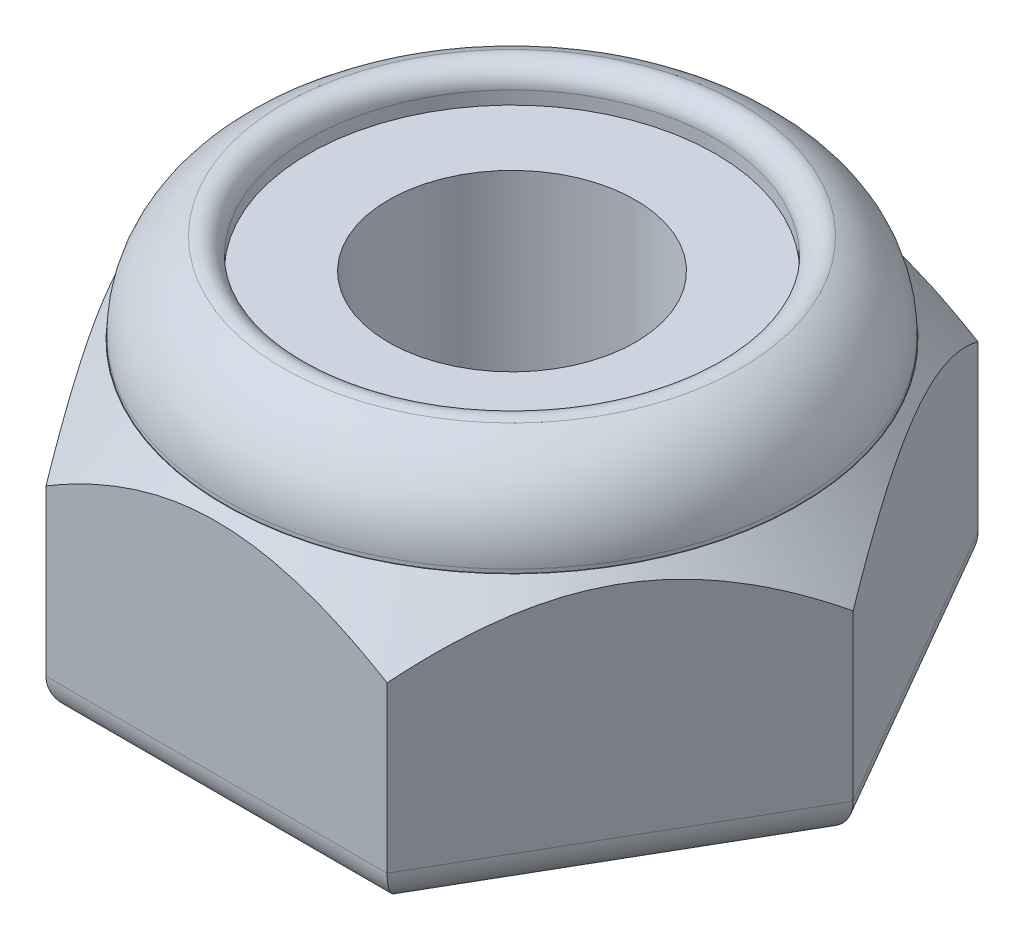
ISO-10303-21;
HEADER;
FILE_DESCRIPTION(('STEP AP214'),'2;1');
FILE_NAME('part.step','',(''),(''),'','','');
FILE_SCHEMA(('AUTOMOTIVE_DESIGN { 1 0 10303 214 1 1 1 1 }'));
ENDSEC;
DATA;
#1=APPLICATION_CONTEXT('core data for automotive mechanical design processes');
#2=APPLICATION_PROTOCOL_DEFINITION('international standard','automotive_design',2000,#1);
#3=PRODUCT_CONTEXT('',#1,'mechanical');
#4=PRODUCT('Part','Part','',(#3));
#5=PRODUCT_RELATED_PRODUCT_CATEGORY('part','',(#4));
#6=PRODUCT_DEFINITION_FORMATION('','',#4);
#7=PRODUCT_DEFINITION_CONTEXT('part definition',#1,'design');
#8=PRODUCT_DEFINITION('design','',#6,#7);
#9=PRODUCT_DEFINITION_SHAPE('','',#8);
#10=(LENGTH_UNIT() NAMED_UNIT(*) SI_UNIT(.MILLI.,.METRE.));
#11=(NAMED_UNIT(*) PLANE_ANGLE_UNIT() SI_UNIT($,.RADIAN.));
#12=(NAMED_UNIT(*) SI_UNIT($,.STERADIAN.) SOLID_ANGLE_UNIT());
#13=UNCERTAINTY_MEASURE_WITH_UNIT(LENGTH_MEASURE(1.E-05),#10,'distance_accuracy_value','');
#14=(GEOMETRIC_REPRESENTATION_CONTEXT(3) GLOBAL_UNCERTAINTY_ASSIGNED_CONTEXT((#13)) GLOBAL_UNIT_ASSIGNED_CONTEXT((#10,
#11,#12)) REPRESENTATION_CONTEXT('',''));
#15=CARTESIAN_POINT('',(0.,0.,0.));
#16=DIRECTION('',(0.,0.,1.));
#17=DIRECTION('',(1.,0.,0.));
#18=AXIS2_PLACEMENT_3D('',#15,#16,#17);
#19=CARTESIAN_POINT('',(0.,4.9784,0.));
#20=DIRECTION('',(0.,-1.,0.));
#21=DIRECTION('',(0.,0.,-1.));
#22=AXIS2_PLACEMENT_3D('',#19,#20,#21);
#23=CYLINDRICAL_SURFACE('',#22,3.937);
#24=CARTESIAN_POINT('',(0.,3.7084,0.));
#25=DIRECTION('',(0.,1.,0.));
#26=DIRECTION('',(0.,0.,1.));
#27=AXIS2_PLACEMENT_3D('',#24,#25,#26);
#28=CIRCLE('',#27,3.937);
#29=CARTESIAN_POINT('',(0.,3.7084,3.937));
#30=VERTEX_POINT('',#29);
#31=EDGE_CURVE('E244',#30,#30,#28,.T.);
#32=ORIENTED_EDGE('',*,*,#31,.F.);
#33=EDGE_LOOP('',(#32));
#34=FACE_BOUND('',#33,.T.);
#35=CARTESIAN_POINT('',(0.,3.6576,0.));
#36=DIRECTION('',(0.,-1.,0.));
#37=DIRECTION('',(0.,0.,-1.));
#38=AXIS2_PLACEMENT_3D('',#35,#36,#37);
#39=CIRCLE('',#38,3.937);
#40=CARTESIAN_POINT('',(0.,3.6576,-3.937));
#41=VERTEX_POINT('',#40);
#42=EDGE_CURVE('E20',#41,#41,#39,.F.);
#43=ORIENTED_EDGE('',*,*,#42,.T.);
#44=EDGE_LOOP('',(#43));
#45=FACE_BOUND('',#44,.T.);
#46=ADVANCED_FACE('F17',(#34,#45),#23,.T.);
#47=CARTESIAN_POINT('',(0.,3.7084,0.));
#48=DIRECTION('',(0.,1.,0.));
#49=DIRECTION('',(0.,0.,1.));
#50=AXIS2_PLACEMENT_3D('',#47,#48,#49);
#51=TOROIDAL_SURFACE('',#50,2.667,1.27);
#52=ORIENTED_EDGE('',*,*,#31,.T.);
#53=EDGE_LOOP('',(#52));
#54=FACE_BOUND('',#53,.T.);
#55=CARTESIAN_POINT('',(0.,4.88572150982644,0.));
#56=DIRECTION('',(0.,-1.,0.));
#57=DIRECTION('',(0.,0.,-1.));
#58=AXIS2_PLACEMENT_3D('',#55,#56,#57);
#59=CIRCLE('',#58,3.14325);
#60=CARTESIAN_POINT('',(0.,4.88572150982644,-3.14325));
#61=VERTEX_POINT('',#60);
#62=EDGE_CURVE('E238',#61,#61,#59,.F.);
#63=ORIENTED_EDGE('',*,*,#62,.F.);
#64=EDGE_LOOP('',(#63));
#65=FACE_BOUND('',#64,.T.);
#66=ADVANCED_FACE('F135',(#54,#65),#51,.T.);
#67=CARTESIAN_POINT('',(2.34315,3.6576,4.05845484975502));
#68=DIRECTION('',(0.,-1.,0.));
#69=DIRECTION('',(0.,0.,-1.));
#70=AXIS2_PLACEMENT_3D('',#67,#68,#69);
#71=PLANE('',#70);
#72=ORIENTED_EDGE('',*,*,#42,.F.);
#73=EDGE_LOOP('',(#72));
#74=FACE_BOUND('',#73,.T.);
#75=CARTESIAN_POINT('',(0.,3.65760000011051,0.));
#76=DIRECTION('',(0.,-1.,0.));
#77=DIRECTION('',(0.,0.,-1.));
#78=AXIS2_PLACEMENT_3D('',#75,#76,#77);
#79=CIRCLE('',#78,3.94407100938664);
#80=CARTESIAN_POINT('',(0.,3.65760000011051,-3.94407100938664));
#81=VERTEX_POINT('',#80);
#82=EDGE_CURVE('E120',#81,#81,#79,.T.);
#83=ORIENTED_EDGE('',*,*,#82,.F.);
#84=EDGE_LOOP('',(#83));
#85=FACE_BOUND('',#84,.T.);
#86=ADVANCED_FACE('F130',(#74,#85),#71,.F.);
#87=CARTESIAN_POINT('',(0.,4.65025720786115,0.));
#88=DIRECTION('',(0.,-1.,0.));
#89=DIRECTION('',(0.,0.,-1.));
#90=AXIS2_PLACEMENT_3D('',#87,#88,#89);
#91=TOROIDAL_SURFACE('',#90,3.048,0.254);
#92=CARTESIAN_POINT('',(0.,4.65025720786115,0.));
#93=DIRECTION('',(0.,1.,0.));
#94=DIRECTION('',(0.,0.,1.));
#95=AXIS2_PLACEMENT_3D('',#92,#93,#94);
#96=CIRCLE('',#95,2.794);
#97=CARTESIAN_POINT('',(0.,4.65025720786115,2.794));
#98=VERTEX_POINT('',#97);
#99=EDGE_CURVE('E105',#98,#98,#96,.F.);
#100=ORIENTED_EDGE('',*,*,#99,.T.);
#101=EDGE_LOOP('',(#100));
#102=FACE_BOUND('',#101,.T.);
#103=ORIENTED_EDGE('',*,*,#62,.T.);
#104=EDGE_LOOP('',(#103));
#105=FACE_BOUND('',#104,.T.);
#106=ADVANCED_FACE('F126',(#102,#105),#91,.T.);
#107=CARTESIAN_POINT('',(0.,2.76773860969115,0.));
#108=DIRECTION('',(0.,-1.,0.));
#109=DIRECTION('',(0.,0.,-1.));
#110=AXIS2_PLACEMENT_3D('',#107,#108,#109);
#111=CONICAL_SURFACE('',#110,4.69075337389313,0.698131700802158);
#112=CARTESIAN_POINT('',(-4.68630000001476,2.77304593398821,-5.3333815551093E-11));
#113=CARTESIAN_POINT('',(-4.65177717141793,2.81418235889091,0.0597952931149053));
#114=CARTESIAN_POINT('',(-4.61695780288956,2.85432113110728,0.120104208500933));
#115=CARTESIAN_POINT('',(-4.54666264441453,2.93230661020916,0.241858994511412));
#116=CARTESIAN_POINT('',(-4.51118655194523,2.97015222462005,0.303305389120424));
#117=CARTESIAN_POINT('',(-4.40329561885259,3.08018701500149,0.490177966909938));
#118=CARTESIAN_POINT('',(-4.32983334004397,3.14837015576205,0.617418366247689));
#119=CARTESIAN_POINT('',(-4.1797796499728,3.27092778609509,0.877318981315214));
#120=CARTESIAN_POINT('',(-4.10317943932402,3.32525984886677,1.00999443802899));
#121=CARTESIAN_POINT('',(-3.94747591651278,3.41577217646147,1.27968085045525));
#122=CARTESIAN_POINT('',(-3.86837998243724,3.45200143013375,1.4166790269463));
#123=CARTESIAN_POINT('',(-3.73746585196202,3.49372811243502,1.64342895235813));
#124=CARTESIAN_POINT('',(-3.68614686019516,3.50560413715319,1.73231605349153));
#125=CARTESIAN_POINT('',(-3.58316406708587,3.52008140702852,1.91068748346216));
#126=CARTESIAN_POINT('',(-3.53150020834088,3.5226810675312,2.00017191172355));
#127=CARTESIAN_POINT('',(-3.42855034551142,3.51847006524789,2.17848630477643));
#128=CARTESIAN_POINT('',(-3.3772638088531,3.51171021118305,2.26731719201287));
#129=CARTESIAN_POINT('',(-3.27519197708947,3.48921023555424,2.4441107906491));
#130=CARTESIAN_POINT('',(-3.22440670715057,3.4734696654174,2.53207345845939));
#131=CARTESIAN_POINT('',(-3.10963060134479,3.42817062222156,2.73087150520989));
#132=CARTESIAN_POINT('',(-3.04589899577138,3.39598542076133,2.84125788411098));
#133=CARTESIAN_POINT('',(-2.92018166739655,3.32004827846255,3.05900668424801));
#134=CARTESIAN_POINT('',(-2.85819691962206,3.27629001415058,3.16636741668776));
#135=CARTESIAN_POINT('',(-2.735889068299,3.17910361386979,3.37821082934389));
#136=CARTESIAN_POINT('',(-2.67557364738244,3.12563730731956,3.48268020285126));
#137=CARTESIAN_POINT('',(-2.55683004320588,3.01104764609313,3.68835015835892));
#138=CARTESIAN_POINT('',(-2.49840123089761,2.94992687749399,3.78955182990274));
#139=CARTESIAN_POINT('',(-2.42439626092569,2.86741854625153,3.91773219790672));
#140=CARTESIAN_POINT('',(-2.40802320106583,2.84883596648691,3.94609116945937));
#141=CARTESIAN_POINT('',(-2.3754621576302,2.81125673907332,4.00248855103733));
#142=CARTESIAN_POINT('',(-2.35927376441604,2.79226151161516,4.03052767057717));
#143=CARTESIAN_POINT('',(-2.3431499999717,2.77304593399368,4.05845484980404));
#144=B_SPLINE_CURVE_WITH_KNOTS('',3,(#112,#113,#114,#115,#116,#117,#118,#119,#120,#121,#122,
#123,#124,#125,#126,#127,#128,#129,#130,#131,#132,#133,#134,#135,#136,#137,#138,#139,#140,#141,
#142,#143),.UNSPECIFIED.,.F.,.F.,(4,2,2,2,2,2,2,2,2,2,2,2,2,2,2,4),(0.,0.241096809088565,
0.48230758945251,0.967637153847365,1.45443592242802,1.93991010956963,2.24950193433618,
2.5591466432483,2.86711700071403,3.17510274216898,3.56882084711336,3.96275452403261,
4.35827201930639,4.75365624679115,4.86660838982693,4.97921936905084),.UNSPECIFIED.);
#145=CARTESIAN_POINT('',(-4.68630000002839,2.77304593399358,0.));
#146=VERTEX_POINT('',#145);
#147=CARTESIAN_POINT('',(-2.34315000001419,2.77304593399358,4.05845484977959));
#148=VERTEX_POINT('',#147);
#149=EDGE_CURVE('E92',#146,#148,#144,.T.);
#150=ORIENTED_EDGE('',*,*,#149,.T.);
#151=CARTESIAN_POINT('',(-2.34315000005357,2.77304593398822,4.05845484974113));
#152=CARTESIAN_POINT('',(-2.27415972170409,2.81414935271336,4.05845484974989));
#153=CARTESIAN_POINT('',(-2.20457738522044,2.85425669884705,4.05845484975361));
#154=CARTESIAN_POINT('',(-2.06410193528096,2.93218331968193,4.05845484975642));
#155=CARTESIAN_POINT('',(-1.99320821641151,2.9700015013142,4.05845484975551));
#156=CARTESIAN_POINT('',(-1.77754688772429,3.07999086386455,4.05845484975401));
#157=CARTESIAN_POINT('',(-1.63068545869954,3.1481589403704,4.05845484975469));
#158=CARTESIAN_POINT('',(-1.33052752457963,3.27077676919262,4.05845484975534));
#159=CARTESIAN_POINT('',(-1.17720631609342,3.32516696804196,4.0584548497553));
#160=CARTESIAN_POINT('',(-0.865613503807779,3.41574608766059,4.05845484975473));
#161=CARTESIAN_POINT('',(-0.707359229311903,3.45199244874899,4.0584548497542));
#162=CARTESIAN_POINT('',(-0.456822143345071,3.49192146546895,4.05845484975548));
#163=CARTESIAN_POINT('',(-0.365672921156202,3.50290887295604,4.05845484975637));
#164=CARTESIAN_POINT('',(-0.183016322004482,3.51758027913678,4.05845484975366));
#165=CARTESIAN_POINT('',(-0.0915105175250817,3.52128341037061,4.05845484975007));
#166=CARTESIAN_POINT('',(0.104649468641441,3.52128177491765,4.0584548497495));
#167=CARTESIAN_POINT('',(0.209305100872023,3.51643705333648,4.05845484975354));
#168=CARTESIAN_POINT('',(0.417787181909869,3.49730239560235,4.05845484975649));
#169=CARTESIAN_POINT('',(0.521613181352877,3.48300765111694,4.05845484975541));
#170=CARTESIAN_POINT('',(0.728332544913562,3.44553375886282,4.05845484975462));
#171=CARTESIAN_POINT('',(0.831215331558566,3.42229697724238,4.05845484975491));
#172=CARTESIAN_POINT('',(1.03487580391125,3.36791830054733,4.05845484975512));
#173=CARTESIAN_POINT('',(1.13565289468809,3.33677420321768,4.05845484975504));
#174=CARTESIAN_POINT('',(1.33273383822163,3.26838741918099,4.05845484975499));
#175=CARTESIAN_POINT('',(1.42908716226035,3.23128582684656,4.05845484975501));
#176=CARTESIAN_POINT('',(1.61947291708309,3.15151071591982,4.05845484975502));
#177=CARTESIAN_POINT('',(1.71350470709807,3.10883567899407,4.05845484975502));
#178=CARTESIAN_POINT('',(1.89803195382395,3.01941532331662,4.05845484975501));
#179=CARTESIAN_POINT('',(1.98855798046432,2.97273255726059,4.05845484975502));
#180=CARTESIAN_POINT('',(2.16742834958163,2.87556944084479,4.05845484975502));
#181=CARTESIAN_POINT('',(2.25577492892455,2.82509321932285,4.05845484975502));
#182=CARTESIAN_POINT('',(2.34315000005566,2.77304593399424,4.05845484975502));
#183=B_SPLINE_CURVE_WITH_KNOTS('',3,(#151,#152,#153,#154,#155,#156,#157,#158,#159,#160,#161,
#162,#163,#164,#165,#166,#167,#168,#169,#170,#171,#172,#173,#174,#175,#176,#177,#178,#179,#180,
#181,#182),.UNSPECIFIED.,.F.,.F.,(4,2,2,2,2,2,2,2,2,2,2,2,2,2,2,4),(0.,0.24090330355952,
0.481920744736242,0.967059466968448,1.4542606837498,1.93990959177135,2.21507934695766,
2.4895253838939,2.80337599596431,3.11738642360394,3.43345557972405,3.74961286055439,
4.0591611810716,4.36879400620232,4.67425708545867,4.97939238068026),.UNSPECIFIED.);
#184=CARTESIAN_POINT('',(2.34315000001419,2.77304593399358,4.05845484977959));
#185=VERTEX_POINT('',#184);
#186=EDGE_CURVE('E84',#148,#185,#183,.T.);
#187=ORIENTED_EDGE('',*,*,#186,.T.);
#188=CARTESIAN_POINT('',(2.3431499999612,2.77304593398822,4.05845484979446));
#189=CARTESIAN_POINT('',(2.37767282857321,2.81418235889091,3.99865955663499));
#190=CARTESIAN_POINT('',(2.41249219710801,2.85432113110729,3.93835064125267));
#191=CARTESIAN_POINT('',(2.48278735558791,2.93230661020917,3.816595855245));
#192=CARTESIAN_POINT('',(2.51826344805563,2.97015222462005,3.75514946063508));
#193=CARTESIAN_POINT('',(2.62615438114571,3.08018701500149,3.56827688284408));
#194=CARTESIAN_POINT('',(2.69961665995557,3.14837015576206,3.44103648350706));
#195=CARTESIAN_POINT('',(2.84967035002766,3.2709277860951,3.18113586844006));
#196=CARTESIAN_POINT('',(2.9262705606761,3.32525984886677,3.04846041172609));
#197=CARTESIAN_POINT('',(3.08197408348711,3.41577217646148,2.77877399929969));
#198=CARTESIAN_POINT('',(3.16107001756274,3.45200143013376,2.64177582280869));
#199=CARTESIAN_POINT('',(3.291984148038,3.49372811243503,2.41502589739689));
#200=CARTESIAN_POINT('',(3.34330313980485,3.50560413715319,2.32613879626348));
#201=CARTESIAN_POINT('',(3.44628593291413,3.52008140702853,2.14776736629285));
#202=CARTESIAN_POINT('',(3.49794979165912,3.52268106753121,2.05828293803146));
#203=CARTESIAN_POINT('',(3.60089965448859,3.51847006524789,1.87996854497858));
#204=CARTESIAN_POINT('',(3.6521861911469,3.51171021118306,1.79113765774214));
#205=CARTESIAN_POINT('',(3.75425802291053,3.48921023555425,1.61434405910591));
#206=CARTESIAN_POINT('',(3.80504329284943,3.47346966541741,1.52638139129562));
#207=CARTESIAN_POINT('',(3.91981939865521,3.42817062222156,1.32758334454512));
#208=CARTESIAN_POINT('',(3.98355100422862,3.39598542076133,1.21719696564403));
#209=CARTESIAN_POINT('',(4.10926833260345,3.32004827846255,0.999448165506999));
#210=CARTESIAN_POINT('',(4.17125308037794,3.27629001415058,0.892087433067251));
#211=CARTESIAN_POINT('',(4.293560931701,3.17910361386979,0.680244020411125));
#212=CARTESIAN_POINT('',(4.35387635261756,3.12563730731956,0.575774646903749));
#213=CARTESIAN_POINT('',(4.47261995679412,3.01104764609313,0.370104691396086));
#214=CARTESIAN_POINT('',(4.53104876910239,2.94992687749399,0.268903019852268));
#215=CARTESIAN_POINT('',(4.60505373907431,2.86741854625153,0.140722651848287));
#216=CARTESIAN_POINT('',(4.62142679893417,2.84883596648691,0.112363680295636));
#217=CARTESIAN_POINT('',(4.6539878423698,2.81125673907332,0.055966298717677));
#218=CARTESIAN_POINT('',(4.67017623558396,2.79226151161516,0.0279271791778412));
#219=CARTESIAN_POINT('',(4.6863000000283,2.77304593399368,-4.90273860582746E-11));
#220=B_SPLINE_CURVE_WITH_KNOTS('',3,(#188,#189,#190,#191,#192,#193,#194,#195,#196,#197,#198,
#199,#200,#201,#202,#203,#204,#205,#206,#207,#208,#209,#210,#211,#212,#213,#214,#215,#216,#217,
#218,#219),.UNSPECIFIED.,.F.,.F.,(4,2,2,2,2,2,2,2,2,2,2,2,2,2,2,4),(0.,0.241096809088565,
0.48230758945251,0.967637153847363,1.45443592242802,1.93991010956962,2.24950193433617,
2.5591466432483,2.86711700071402,3.17510274216897,3.56882084711335,3.9627545240326,
4.35827201930639,4.75365624679114,4.86660838982692,4.97921936905084),.UNSPECIFIED.);
#221=CARTESIAN_POINT('',(4.68630000001419,2.7730459340105,-2.45821360759307E-11));
#222=VERTEX_POINT('',#221);
#223=EDGE_CURVE('E89',#185,#222,#220,.T.);
#224=ORIENTED_EDGE('',*,*,#223,.T.);
#225=CARTESIAN_POINT('',(4.68630000001476,2.77304593398822,5.33267015141622E-11));
#226=CARTESIAN_POINT('',(4.65177717141792,2.81418235889091,-0.0597952931149122));
#227=CARTESIAN_POINT('',(4.61695780288956,2.85432113110729,-0.12010420850094));
#228=CARTESIAN_POINT('',(4.54666264441452,2.93230661020917,-0.241858994511418));
#229=CARTESIAN_POINT('',(4.51118655194522,2.97015222462005,-0.303305389120429));
#230=CARTESIAN_POINT('',(4.40329561885258,3.0801870150015,-0.490177966909942));
#231=CARTESIAN_POINT('',(4.32983334004397,3.14837015576206,-0.617418366247694));
#232=CARTESIAN_POINT('',(4.1797796499728,3.27092778609509,-0.877318981315217));
#233=CARTESIAN_POINT('',(4.10317943932402,3.32525984886677,-1.00999443802899));
#234=CARTESIAN_POINT('',(3.94747591651277,3.41577217646148,-1.27968085045525));
#235=CARTESIAN_POINT('',(3.86837998243724,3.45200143013375,-1.4166790269463));
#236=CARTESIAN_POINT('',(3.73746585196202,3.49372811243502,-1.64342895235813));
#237=CARTESIAN_POINT('',(3.68614686019516,3.50560413715319,-1.73231605349153));
#238=CARTESIAN_POINT('',(3.58316406708587,3.52008140702852,-1.91068748346216));
#239=CARTESIAN_POINT('',(3.53150020834088,3.5226810675312,-2.00017191172355));
#240=CARTESIAN_POINT('',(3.42855034551142,3.51847006524789,-2.17848630477643));
#241=CARTESIAN_POINT('',(3.3772638088531,3.51171021118306,-2.26731719201287));
#242=CARTESIAN_POINT('',(3.27519197708948,3.48921023555424,-2.4441107906491));
#243=CARTESIAN_POINT('',(3.22440670715057,3.4734696654174,-2.53207345845939));
#244=CARTESIAN_POINT('',(3.10963060134479,3.42817062222156,-2.73087150520989));
#245=CARTESIAN_POINT('',(3.04589899577138,3.39598542076133,-2.84125788411098));
#246=CARTESIAN_POINT('',(2.92018166739655,3.32004827846255,-3.05900668424801));
#247=CARTESIAN_POINT('',(2.85819691962206,3.27629001415058,-3.16636741668776));
#248=CARTESIAN_POINT('',(2.735889068299,3.17910361386979,-3.37821082934388));
#249=CARTESIAN_POINT('',(2.67557364738245,3.12563730731956,-3.48268020285126));
#250=CARTESIAN_POINT('',(2.55683004320588,3.01104764609313,-3.68835015835892));
#251=CARTESIAN_POINT('',(2.49840123089762,2.94992687749399,-3.78955182990274));
#252=CARTESIAN_POINT('',(2.42439626092569,2.86741854625153,-3.91773219790672));
#253=CARTESIAN_POINT('',(2.40802320106583,2.84883596648691,-3.94609116945937));
#254=CARTESIAN_POINT('',(2.3754621576302,2.81125673907332,-4.00248855103733));
#255=CARTESIAN_POINT('',(2.35927376441604,2.79226151161516,-4.03052767057717));
#256=CARTESIAN_POINT('',(2.3431499999717,2.77304593399368,-4.05845484980404));
#257=B_SPLINE_CURVE_WITH_KNOTS('',3,(#225,#226,#227,#228,#229,#230,#231,#232,#233,#234,#235,
#236,#237,#238,#239,#240,#241,#242,#243,#244,#245,#246,#247,#248,#249,#250,#251,#252,#253,#254,
#255,#256),.UNSPECIFIED.,.F.,.F.,(4,2,2,2,2,2,2,2,2,2,2,2,2,2,2,4),(0.,0.241096809088564,
0.482307589452508,0.96763715384736,1.45443592242801,1.93991010956962,2.24950193433616,
2.55914664324829,2.86711700071401,3.17510274216896,3.56882084711335,3.96275452403259,
4.35827201930638,4.75365624679113,4.86660838982692,4.97921936905084),.UNSPECIFIED.);
#258=CARTESIAN_POINT('',(2.34315000001419,2.77304593399358,-4.0584548497796));
#259=VERTEX_POINT('',#258);
#260=EDGE_CURVE('E194',#222,#259,#257,.T.);
#261=ORIENTED_EDGE('',*,*,#260,.T.);
#262=CARTESIAN_POINT('',(2.34315000005357,2.77304593398821,-4.05845484974114));
#263=CARTESIAN_POINT('',(2.27415972170409,2.81414935271335,-4.05845484974989));
#264=CARTESIAN_POINT('',(2.20457738522045,2.85425669884704,-4.05845484975361));
#265=CARTESIAN_POINT('',(2.06410193528096,2.93218331968193,-4.05845484975643));
#266=CARTESIAN_POINT('',(1.99320821641151,2.97000150131419,-4.05845484975552));
#267=CARTESIAN_POINT('',(1.77754688772429,3.07999086386454,-4.05845484975402));
#268=CARTESIAN_POINT('',(1.63068545869954,3.1481589403704,-4.0584548497547));
#269=CARTESIAN_POINT('',(1.33052752457963,3.27077676919261,-4.05845484975534));
#270=CARTESIAN_POINT('',(1.17720631609342,3.32516696804195,-4.0584548497553));
#271=CARTESIAN_POINT('',(0.865613503807778,3.41574608766058,-4.05845484975474));
#272=CARTESIAN_POINT('',(0.707359229311901,3.45199244874898,-4.0584548497542));
#273=CARTESIAN_POINT('',(0.456822143345069,3.49192146546895,-4.05845484975548));
#274=CARTESIAN_POINT('',(0.365672921156201,3.50290887295604,-4.05845484975637));
#275=CARTESIAN_POINT('',(0.183016322004481,3.51758027913677,-4.05845484975367));
#276=CARTESIAN_POINT('',(0.0915105175250814,3.5212834103706,-4.05845484975008));
#277=CARTESIAN_POINT('',(-0.104649468641441,3.52128177491764,-4.0584548497495));
#278=CARTESIAN_POINT('',(-0.209305100872023,3.51643705333648,-4.05845484975354));
#279=CARTESIAN_POINT('',(-0.41778718190987,3.49730239560234,-4.0584548497565));
#280=CARTESIAN_POINT('',(-0.521613181352877,3.48300765111693,-4.05845484975542));
#281=CARTESIAN_POINT('',(-0.728332544913562,3.44553375886281,-4.05845484975462));
#282=CARTESIAN_POINT('',(-0.831215331558566,3.42229697724237,-4.05845484975491));
#283=CARTESIAN_POINT('',(-1.03487580391125,3.36791830054732,-4.05845484975513));
#284=CARTESIAN_POINT('',(-1.13565289468809,3.33677420321767,-4.05845484975505));
#285=CARTESIAN_POINT('',(-1.33273383822163,3.26838741918098,-4.05845484975499));
#286=CARTESIAN_POINT('',(-1.42908716226035,3.23128582684655,-4.05845484975501));
#287=CARTESIAN_POINT('',(-1.61947291708309,3.15151071591982,-4.05845484975503));
#288=CARTESIAN_POINT('',(-1.71350470709807,3.10883567899406,-4.05845484975502));
#289=CARTESIAN_POINT('',(-1.89803195382395,3.01941532331662,-4.05845484975502));
#290=CARTESIAN_POINT('',(-1.98855798046431,2.97273255726059,-4.05845484975502));
#291=CARTESIAN_POINT('',(-2.16742834958162,2.87556944084479,-4.05845484975502));
#292=CARTESIAN_POINT('',(-2.25577492892455,2.82509321932284,-4.05845484975502));
#293=CARTESIAN_POINT('',(-2.34315000005566,2.77304593399424,-4.05845484975502));
#294=B_SPLINE_CURVE_WITH_KNOTS('',3,(#262,#263,#264,#265,#266,#267,#268,#269,#270,#271,#272,
#273,#274,#275,#276,#277,#278,#279,#280,#281,#282,#283,#284,#285,#286,#287,#288,#289,#290,#291,
#292,#293),.UNSPECIFIED.,.F.,.F.,(4,2,2,2,2,2,2,2,2,2,2,2,2,2,2,4),(0.,0.24090330355952,
0.481920744736243,0.96705946696845,1.4542606837498,1.93990959177135,2.21507934695766,
2.48952538389391,2.80337599596432,3.11738642360394,3.43345557972405,3.74961286055439,
4.0591611810716,4.36879400620232,4.67425708545866,4.97939238068026),.UNSPECIFIED.);
#295=CARTESIAN_POINT('',(-2.34315000001419,2.77304593399358,-4.0584548497796));
#296=VERTEX_POINT('',#295);
#297=EDGE_CURVE('E204',#259,#296,#294,.T.);
#298=ORIENTED_EDGE('',*,*,#297,.T.);
#299=CARTESIAN_POINT('',(-2.3431499999612,2.77304593398821,-4.05845484979447));
#300=CARTESIAN_POINT('',(-2.37767282857321,2.81418235889091,-3.99865955663499));
#301=CARTESIAN_POINT('',(-2.41249219710802,2.85432113110728,-3.93835064125268));
#302=CARTESIAN_POINT('',(-2.48278735558791,2.93230661020916,-3.81659585524501));
#303=CARTESIAN_POINT('',(-2.51826344805563,2.97015222462005,-3.75514946063508));
#304=CARTESIAN_POINT('',(-2.62615438114571,3.08018701500149,-3.56827688284409));
#305=CARTESIAN_POINT('',(-2.69961665995557,3.14837015576205,-3.44103648350706));
#306=CARTESIAN_POINT('',(-2.84967035002766,3.27092778609509,-3.18113586844007));
#307=CARTESIAN_POINT('',(-2.9262705606761,3.32525984886676,-3.0484604117261));
#308=CARTESIAN_POINT('',(-3.08197408348711,3.41577217646147,-2.7787739992997));
#309=CARTESIAN_POINT('',(-3.16107001756274,3.45200143013375,-2.6417758228087));
#310=CARTESIAN_POINT('',(-3.291984148038,3.49372811243502,-2.4150258973969));
#311=CARTESIAN_POINT('',(-3.34330313980485,3.50560413715318,-2.32613879626349));
#312=CARTESIAN_POINT('',(-3.44628593291413,3.52008140702852,-2.14776736629286));
#313=CARTESIAN_POINT('',(-3.49794979165912,3.5226810675312,-2.05828293803147));
#314=CARTESIAN_POINT('',(-3.60089965448859,3.51847006524788,-1.87996854497859));
#315=CARTESIAN_POINT('',(-3.6521861911469,3.51171021118305,-1.79113765774214));
#316=CARTESIAN_POINT('',(-3.75425802291053,3.48921023555424,-1.61434405910592));
#317=CARTESIAN_POINT('',(-3.80504329284944,3.4734696654174,-1.52638139129563));
#318=CARTESIAN_POINT('',(-3.91981939865521,3.42817062222155,-1.32758334454512));
#319=CARTESIAN_POINT('',(-3.98355100422863,3.39598542076132,-1.21719696564403));
#320=CARTESIAN_POINT('',(-4.10926833260346,3.32004827846254,-0.999448165507007));
#321=CARTESIAN_POINT('',(-4.17125308037794,3.27629001415057,-0.892087433067258));
#322=CARTESIAN_POINT('',(-4.29356093170101,3.17910361386978,-0.680244020411132));
#323=CARTESIAN_POINT('',(-4.35387635261756,3.12563730731955,-0.575774646903757));
#324=CARTESIAN_POINT('',(-4.47261995679413,3.01104764609312,-0.370104691396094));
#325=CARTESIAN_POINT('',(-4.53104876910239,2.94992687749399,-0.268903019852276));
#326=CARTESIAN_POINT('',(-4.60505373907432,2.86741854625152,-0.140722651848295));
#327=CARTESIAN_POINT('',(-4.62142679893418,2.84883596648691,-0.112363680295645));
#328=CARTESIAN_POINT('',(-4.6539878423698,2.81125673907331,-0.0559662987176857));
#329=CARTESIAN_POINT('',(-4.67017623558397,2.79226151161515,-0.0279271791778497));
#330=CARTESIAN_POINT('',(-4.68630000002831,2.77304593399367,4.90190782069009E-11));
#331=B_SPLINE_CURVE_WITH_KNOTS('',3,(#299,#300,#301,#302,#303,#304,#305,#306,#307,#308,#309,
#310,#311,#312,#313,#314,#315,#316,#317,#318,#319,#320,#321,#322,#323,#324,#325,#326,#327,#328,
#329,#330),.UNSPECIFIED.,.F.,.F.,(4,2,2,2,2,2,2,2,2,2,2,2,2,2,2,4),(0.,0.241096809088564,
0.482307589452509,0.967637153847362,1.45443592242802,1.93991010956962,2.24950193433617,
2.5591466432483,2.86711700071402,3.17510274216897,3.56882084711335,3.9627545240326,
4.35827201930639,4.75365624679114,4.86660838982692,4.97921936905084),.UNSPECIFIED.);
#332=EDGE_CURVE('E210',#296,#146,#331,.T.);
#333=ORIENTED_EDGE('',*,*,#332,.T.);
#334=EDGE_LOOP('',(#150,#187,#224,#261,#298,#333));
#335=FACE_BOUND('',#334,.T.);
#336=ORIENTED_EDGE('',*,*,#82,.T.);
#337=EDGE_LOOP('',(#336));
#338=FACE_BOUND('',#337,.T.);
#339=ADVANCED_FACE('F86',(#335,#338),#111,.T.);
#340=CARTESIAN_POINT('',(0.,4.4704,0.));
#341=DIRECTION('',(0.,1.,0.));
#342=DIRECTION('',(0.,0.,1.));
#343=AXIS2_PLACEMENT_3D('',#340,#341,#342);
#344=CYLINDRICAL_SURFACE('',#343,2.794);
#345=ORIENTED_EDGE('',*,*,#99,.F.);
#346=EDGE_LOOP('',(#345));
#347=FACE_BOUND('',#346,.T.);
#348=CARTESIAN_POINT('',(0.,4.4704,0.));
#349=DIRECTION('',(0.,1.,0.));
#350=DIRECTION('',(0.,0.,1.));
#351=AXIS2_PLACEMENT_3D('',#348,#349,#350);
#352=CIRCLE('',#351,2.794);
#353=CARTESIAN_POINT('',(0.,4.4704,2.794));
#354=VERTEX_POINT('',#353);
#355=EDGE_CURVE('E202',#354,#354,#352,.T.);
#356=ORIENTED_EDGE('',*,*,#355,.F.);
#357=EDGE_LOOP('',(#356));
#358=FACE_BOUND('',#357,.T.);
#359=ADVANCED_FACE('F406',(#347,#358),#344,.F.);
#360=CARTESIAN_POINT('',(2.34315,3.6576,4.05845484975502));
#361=DIRECTION('',(-0.866025403784439,0.,-0.499999999999999));
#362=DIRECTION('',(-0.499999999999999,0.,0.866025403784439));
#363=AXIS2_PLACEMENT_3D('',#360,#361,#362);
#364=PLANE('',#363);
#365=DIRECTION('',(-0.499999999999999,0.,0.866025403784439));
#366=VECTOR('',#365,1.);
#367=CARTESIAN_POINT('',(2.34315,0.508,4.05845484975502));
#368=LINE('',#367,#366);
#369=CARTESIAN_POINT('',(4.6863,0.508,0.));
#370=VERTEX_POINT('',#369);
#371=CARTESIAN_POINT('',(2.34315000000001,0.508,4.05845484975502));
#372=VERTEX_POINT('',#371);
#373=EDGE_CURVE('E268',#370,#372,#368,.T.);
#374=ORIENTED_EDGE('',*,*,#373,.F.);
#375=DIRECTION('',(0.,1.,0.));
#376=VECTOR('',#375,1.);
#377=CARTESIAN_POINT('',(4.6863,3.6576,0.));
#378=LINE('',#377,#376);
#379=EDGE_CURVE('E103',#370,#222,#378,.T.);
#380=ORIENTED_EDGE('',*,*,#379,.T.);
#381=ORIENTED_EDGE('',*,*,#223,.F.);
#382=DIRECTION('',(0.,1.,0.));
#383=VECTOR('',#382,1.);
#384=CARTESIAN_POINT('',(2.34315000000001,3.6576,4.05845484975502));
#385=LINE('',#384,#383);
#386=EDGE_CURVE('E96',#185,#372,#385,.F.);
#387=ORIENTED_EDGE('',*,*,#386,.T.);
#388=EDGE_LOOP('',(#374,#380,#381,#387));
#389=FACE_BOUND('',#388,.T.);
#390=ADVANCED_FACE('F100',(#389),#364,.F.);
#391=CARTESIAN_POINT('',(-2.34315,3.6576,4.05845484975501));
#392=DIRECTION('',(0.,0.,-1.));
#393=DIRECTION('',(-1.,0.,0.));
#394=AXIS2_PLACEMENT_3D('',#391,#392,#393);
#395=PLANE('',#394);
#396=DIRECTION('',(-1.,0.,0.));
#397=VECTOR('',#396,1.);
#398=CARTESIAN_POINT('',(-2.34315,0.508,4.05845484975501));
#399=LINE('',#398,#397);
#400=CARTESIAN_POINT('',(-2.34315,0.508,4.05845484975501));
#401=VERTEX_POINT('',#400);
#402=EDGE_CURVE('E110',#372,#401,#399,.T.);
#403=ORIENTED_EDGE('',*,*,#402,.F.);
#404=ORIENTED_EDGE('',*,*,#386,.F.);
#405=ORIENTED_EDGE('',*,*,#186,.F.);
#406=DIRECTION('',(0.,1.,0.));
#407=VECTOR('',#406,1.);
#408=CARTESIAN_POINT('',(-2.34315,3.6576,4.05845484975501));
#409=LINE('',#408,#407);
#410=EDGE_CURVE('E113',#148,#401,#409,.F.);
#411=ORIENTED_EDGE('',*,*,#410,.T.);
#412=EDGE_LOOP('',(#403,#404,#405,#411));
#413=FACE_BOUND('',#412,.T.);
#414=ADVANCED_FACE('F108',(#413),#395,.F.);
#415=CARTESIAN_POINT('',(-4.6863,3.6576,0.));
#416=DIRECTION('',(0.866025403784439,0.,-0.5));
#417=DIRECTION('',(-0.5,0.,-0.866025403784439));
#418=AXIS2_PLACEMENT_3D('',#415,#416,#417);
#419=PLANE('',#418);
#420=DIRECTION('',(-0.5,0.,-0.866025403784439));
#421=VECTOR('',#420,1.);
#422=CARTESIAN_POINT('',(-4.6863,0.508,0.));
#423=LINE('',#422,#421);
#424=CARTESIAN_POINT('',(-4.6863,0.508,0.));
#425=VERTEX_POINT('',#424);
#426=EDGE_CURVE('E264',#401,#425,#423,.T.);
#427=ORIENTED_EDGE('',*,*,#426,.F.);
#428=ORIENTED_EDGE('',*,*,#410,.F.);
#429=ORIENTED_EDGE('',*,*,#149,.F.);
#430=DIRECTION('',(0.,1.,0.));
#431=VECTOR('',#430,1.);
#432=CARTESIAN_POINT('',(-4.6863,3.6576,0.));
#433=LINE('',#432,#431);
#434=EDGE_CURVE('E209',#146,#425,#433,.F.);
#435=ORIENTED_EDGE('',*,*,#434,.T.);
#436=EDGE_LOOP('',(#427,#428,#429,#435));
#437=FACE_BOUND('',#436,.T.);
#438=ADVANCED_FACE('F221',(#437),#419,.F.);
#439=CARTESIAN_POINT('',(-2.34315,3.6576,-4.05845484975502));
#440=DIRECTION('',(0.866025403784438,0.,0.5));
#441=DIRECTION('',(0.5,0.,-0.866025403784438));
#442=AXIS2_PLACEMENT_3D('',#439,#440,#441);
#443=PLANE('',#442);
#444=DIRECTION('',(0.5,0.,-0.866025403784438));
#445=VECTOR('',#444,1.);
#446=CARTESIAN_POINT('',(-2.34315,0.508,-4.05845484975502));
#447=LINE('',#446,#445);
#448=CARTESIAN_POINT('',(-2.34315,0.508,-4.05845484975502));
#449=VERTEX_POINT('',#448);
#450=EDGE_CURVE('E260',#425,#449,#447,.T.);
#451=ORIENTED_EDGE('',*,*,#450,.F.);
#452=ORIENTED_EDGE('',*,*,#434,.F.);
#453=ORIENTED_EDGE('',*,*,#332,.F.);
#454=DIRECTION('',(0.,1.,0.));
#455=VECTOR('',#454,1.);
#456=CARTESIAN_POINT('',(-2.34315,3.6576,-4.05845484975502));
#457=LINE('',#456,#455);
#458=EDGE_CURVE('E201',#296,#449,#457,.F.);
#459=ORIENTED_EDGE('',*,*,#458,.T.);
#460=EDGE_LOOP('',(#451,#452,#453,#459));
#461=FACE_BOUND('',#460,.T.);
#462=ADVANCED_FACE('F218',(#461),#443,.F.);
#463=CARTESIAN_POINT('',(2.34315,3.6576,-4.05845484975502));
#464=DIRECTION('',(0.,0.,1.));
#465=DIRECTION('',(1.,0.,0.));
#466=AXIS2_PLACEMENT_3D('',#463,#464,#465);
#467=PLANE('',#466);
#468=DIRECTION('',(1.,0.,0.));
#469=VECTOR('',#468,1.);
#470=CARTESIAN_POINT('',(2.34315,0.508,-4.05845484975502));
#471=LINE('',#470,#469);
#472=CARTESIAN_POINT('',(2.34315,0.508,-4.05845484975502));
#473=VERTEX_POINT('',#472);
#474=EDGE_CURVE('E256',#449,#473,#471,.T.);
#475=ORIENTED_EDGE('',*,*,#474,.F.);
#476=ORIENTED_EDGE('',*,*,#458,.F.);
#477=ORIENTED_EDGE('',*,*,#297,.F.);
#478=DIRECTION('',(0.,1.,0.));
#479=VECTOR('',#478,1.);
#480=CARTESIAN_POINT('',(2.34315,3.6576,-4.05845484975501));
#481=LINE('',#480,#479);
#482=EDGE_CURVE('E200',#259,#473,#481,.F.);
#483=ORIENTED_EDGE('',*,*,#482,.T.);
#484=EDGE_LOOP('',(#475,#476,#477,#483));
#485=FACE_BOUND('',#484,.T.);
#486=ADVANCED_FACE('F189',(#485),#467,.F.);
#487=CARTESIAN_POINT('',(4.6863,3.6576,0.));
#488=DIRECTION('',(-0.866025403784439,0.,0.5));
#489=DIRECTION('',(0.5,0.,0.866025403784439));
#490=AXIS2_PLACEMENT_3D('',#487,#488,#489);
#491=PLANE('',#490);
#492=DIRECTION('',(0.5,0.,0.866025403784439));
#493=VECTOR('',#492,1.);
#494=CARTESIAN_POINT('',(4.6863,0.508,0.));
#495=LINE('',#494,#493);
#496=EDGE_CURVE('E254',#473,#370,#495,.T.);
#497=ORIENTED_EDGE('',*,*,#496,.F.);
#498=ORIENTED_EDGE('',*,*,#482,.F.);
#499=ORIENTED_EDGE('',*,*,#260,.F.);
#500=ORIENTED_EDGE('',*,*,#379,.F.);
#501=EDGE_LOOP('',(#497,#498,#499,#500));
#502=FACE_BOUND('',#501,.T.);
#503=ADVANCED_FACE('F184',(#502),#491,.F.);
#504=CARTESIAN_POINT('',(0.,4.4704,0.));
#505=DIRECTION('',(0.,1.,0.));
#506=DIRECTION('',(0.,0.,1.));
#507=AXIS2_PLACEMENT_3D('',#504,#505,#506);
#508=PLANE('',#507);
#509=CARTESIAN_POINT('',(0.,4.4704,0.));
#510=DIRECTION('',(0.,1.,0.));
#511=DIRECTION('',(0.,0.,1.));
#512=AXIS2_PLACEMENT_3D('',#509,#510,#511);
#513=CIRCLE('',#512,1.69545);
#514=CARTESIAN_POINT('',(0.,4.4704,1.69545));
#515=VERTEX_POINT('',#514);
#516=EDGE_CURVE('E247',#515,#515,#513,.F.);
#517=ORIENTED_EDGE('',*,*,#516,.T.);
#518=EDGE_LOOP('',(#517));
#519=FACE_BOUND('',#518,.T.);
#520=ORIENTED_EDGE('',*,*,#355,.T.);
#521=EDGE_LOOP('',(#520));
#522=FACE_BOUND('',#521,.T.);
#523=ADVANCED_FACE('F180',(#519,#522),#508,.T.);
#524=CARTESIAN_POINT('',(1.9032090948775,0.508,3.80445484975502));
#525=DIRECTION('',(-0.499999999999999,0.,0.866025403784439));
#526=DIRECTION('',(0.866025403784439,0.,0.499999999999999));
#527=AXIS2_PLACEMENT_3D('',#524,#525,#526);
#528=CYLINDRICAL_SURFACE('',#527,0.508);
#529=CARTESIAN_POINT('',(2.04985606325167,0.508,3.55045484975502));
#530=DIRECTION('',(-0.866025403784439,0.,0.5));
#531=DIRECTION('',(-0.5,0.,-0.866025403784439));
#532=AXIS2_PLACEMENT_3D('',#529,#530,#531);
#533=ELLIPSE('',#532,0.58658787349666,0.508);
#534=CARTESIAN_POINT('',(2.04985606325167,0.,3.55045484975502));
#535=VERTEX_POINT('',#534);
#536=EDGE_CURVE('E267',#535,#372,#533,.T.);
#537=ORIENTED_EDGE('',*,*,#536,.F.);
#538=DIRECTION('',(-0.499999999999999,0.,0.866025403784439));
#539=VECTOR('',#538,1.);
#540=CARTESIAN_POINT('',(4.09971212650334,0.,0.));
#541=LINE('',#540,#539);
#542=CARTESIAN_POINT('',(4.09971212650334,0.,0.));
#543=VERTEX_POINT('',#542);
#544=EDGE_CURVE('E250',#543,#535,#541,.T.);
#545=ORIENTED_EDGE('',*,*,#544,.F.);
#546=CARTESIAN_POINT('',(4.09971212650334,0.508,0.));
#547=DIRECTION('',(0.,0.,1.));
#548=DIRECTION('',(1.,0.,0.));
#549=AXIS2_PLACEMENT_3D('',#546,#547,#548);
#550=ELLIPSE('',#549,0.58658787349666,0.508);
#551=EDGE_CURVE('E251',#370,#543,#550,.F.);
#552=ORIENTED_EDGE('',*,*,#551,.F.);
#553=ORIENTED_EDGE('',*,*,#373,.T.);
#554=EDGE_LOOP('',(#537,#545,#552,#553));
#555=FACE_BOUND('',#554,.T.);
#556=ADVANCED_FACE('F176',(#555),#528,.T.);
#557=CARTESIAN_POINT('',(-2.34315,0.508,3.55045484975501));
#558=DIRECTION('',(-1.,0.,0.));
#559=DIRECTION('',(0.,0.,1.));
#560=AXIS2_PLACEMENT_3D('',#557,#558,#559);
#561=CYLINDRICAL_SURFACE('',#560,0.508);
#562=ORIENTED_EDGE('',*,*,#536,.T.);
#563=ORIENTED_EDGE('',*,*,#402,.T.);
#564=CARTESIAN_POINT('',(-2.04985606325167,0.508,3.55045484975501));
#565=DIRECTION('',(-0.866025403784439,0.,-0.5));
#566=DIRECTION('',(0.5,0.,-0.866025403784439));
#567=AXIS2_PLACEMENT_3D('',#564,#565,#566);
#568=ELLIPSE('',#567,0.58658787349666,0.508);
#569=CARTESIAN_POINT('',(-2.04985606325167,0.,3.55045484975502));
#570=VERTEX_POINT('',#569);
#571=EDGE_CURVE('E265',#570,#401,#568,.T.);
#572=ORIENTED_EDGE('',*,*,#571,.F.);
#573=DIRECTION('',(1.,0.,0.));
#574=VECTOR('',#573,1.);
#575=CARTESIAN_POINT('',(2.34315,0.,3.55045484975502));
#576=LINE('',#575,#574);
#577=EDGE_CURVE('E299',#535,#570,#576,.F.);
#578=ORIENTED_EDGE('',*,*,#577,.F.);
#579=EDGE_LOOP('',(#562,#563,#572,#578));
#580=FACE_BOUND('',#579,.T.);
#581=ADVANCED_FACE('F172',(#580),#561,.T.);
#582=CARTESIAN_POINT('',(-4.24635909487751,0.508,-0.254000000000004));
#583=DIRECTION('',(-0.5,0.,-0.866025403784439));
#584=DIRECTION('',(-0.866025403784439,0.,0.5));
#585=AXIS2_PLACEMENT_3D('',#582,#583,#584);
#586=CYLINDRICAL_SURFACE('',#585,0.508);
#587=ORIENTED_EDGE('',*,*,#571,.T.);
#588=ORIENTED_EDGE('',*,*,#426,.T.);
#589=CARTESIAN_POINT('',(-4.09971212650334,0.508,0.));
#590=DIRECTION('',(0.,0.,-1.));
#591=DIRECTION('',(1.,0.,0.));
#592=AXIS2_PLACEMENT_3D('',#589,#590,#591);
#593=ELLIPSE('',#592,0.58658787349666,0.508);
#594=CARTESIAN_POINT('',(-4.09971212650334,0.,0.));
#595=VERTEX_POINT('',#594);
#596=EDGE_CURVE('E261',#595,#425,#593,.T.);
#597=ORIENTED_EDGE('',*,*,#596,.F.);
#598=DIRECTION('',(-0.5,0.,-0.866025403784439));
#599=VECTOR('',#598,1.);
#600=CARTESIAN_POINT('',(-2.04985606325167,0.,3.55045484975501));
#601=LINE('',#600,#599);
#602=EDGE_CURVE('E295',#570,#595,#601,.T.);
#603=ORIENTED_EDGE('',*,*,#602,.F.);
#604=EDGE_LOOP('',(#587,#588,#597,#603));
#605=FACE_BOUND('',#604,.T.);
#606=ADVANCED_FACE('F168',(#605),#586,.T.);
#607=CARTESIAN_POINT('',(-1.90320909487751,0.508,-3.80445484975502));
#608=DIRECTION('',(0.5,0.,-0.866025403784438));
#609=DIRECTION('',(-0.866025403784438,0.,-0.5));
#610=AXIS2_PLACEMENT_3D('',#607,#608,#609);
#611=CYLINDRICAL_SURFACE('',#610,0.508);
#612=ORIENTED_EDGE('',*,*,#596,.T.);
#613=ORIENTED_EDGE('',*,*,#450,.T.);
#614=CARTESIAN_POINT('',(-2.04985606325167,0.508,-3.55045484975502));
#615=DIRECTION('',(0.866025403784439,0.,-0.5));
#616=DIRECTION('',(0.5,0.,0.866025403784439));
#617=AXIS2_PLACEMENT_3D('',#614,#615,#616);
#618=ELLIPSE('',#617,0.58658787349666,0.508);
#619=CARTESIAN_POINT('',(-2.04985606325167,0.,-3.55045484975502));
#620=VERTEX_POINT('',#619);
#621=EDGE_CURVE('E257',#620,#449,#618,.T.);
#622=ORIENTED_EDGE('',*,*,#621,.F.);
#623=DIRECTION('',(0.5,0.,-0.866025403784438));
#624=VECTOR('',#623,1.);
#625=CARTESIAN_POINT('',(-4.09971212650334,0.,0.));
#626=LINE('',#625,#624);
#627=EDGE_CURVE('E291',#595,#620,#626,.T.);
#628=ORIENTED_EDGE('',*,*,#627,.F.);
#629=EDGE_LOOP('',(#612,#613,#622,#628));
#630=FACE_BOUND('',#629,.T.);
#631=ADVANCED_FACE('F165',(#630),#611,.T.);
#632=CARTESIAN_POINT('',(2.34315,0.508,-3.55045484975502));
#633=DIRECTION('',(1.,0.,0.));
#634=DIRECTION('',(0.,0.,-1.));
#635=AXIS2_PLACEMENT_3D('',#632,#633,#634);
#636=CYLINDRICAL_SURFACE('',#635,0.508);
#637=ORIENTED_EDGE('',*,*,#621,.T.);
#638=ORIENTED_EDGE('',*,*,#474,.T.);
#639=CARTESIAN_POINT('',(2.04985606325167,0.508,-3.55045484975502));
#640=DIRECTION('',(0.866025403784439,0.,0.5));
#641=DIRECTION('',(-0.5,0.,0.866025403784439));
#642=AXIS2_PLACEMENT_3D('',#639,#640,#641);
#643=ELLIPSE('',#642,0.58658787349666,0.508);
#644=CARTESIAN_POINT('',(2.04985606325167,0.,-3.55045484975502));
#645=VERTEX_POINT('',#644);
#646=EDGE_CURVE('E35',#645,#473,#643,.T.);
#647=ORIENTED_EDGE('',*,*,#646,.F.);
#648=DIRECTION('',(1.,0.,0.));
#649=VECTOR('',#648,1.);
#650=CARTESIAN_POINT('',(2.34315,0.,-3.55045484975502));
#651=LINE('',#650,#649);
#652=EDGE_CURVE('E294',#620,#645,#651,.T.);
#653=ORIENTED_EDGE('',*,*,#652,.F.);
#654=EDGE_LOOP('',(#637,#638,#647,#653));
#655=FACE_BOUND('',#654,.T.);
#656=ADVANCED_FACE('F161',(#655),#636,.T.);
#657=CARTESIAN_POINT('',(4.2463590948775,0.508,0.253999999999996));
#658=DIRECTION('',(0.5,0.,0.866025403784439));
#659=DIRECTION('',(0.866025403784439,0.,-0.5));
#660=AXIS2_PLACEMENT_3D('',#657,#658,#659);
#661=CYLINDRICAL_SURFACE('',#660,0.508);
#662=ORIENTED_EDGE('',*,*,#551,.T.);
#663=DIRECTION('',(0.5,0.,0.866025403784439));
#664=VECTOR('',#663,1.);
#665=CARTESIAN_POINT('',(2.04985606325167,0.,-3.55045484975502));
#666=LINE('',#665,#664);
#667=EDGE_CURVE('E26',#645,#543,#666,.T.);
#668=ORIENTED_EDGE('',*,*,#667,.F.);
#669=ORIENTED_EDGE('',*,*,#646,.T.);
#670=ORIENTED_EDGE('',*,*,#496,.T.);
#671=EDGE_LOOP('',(#662,#668,#669,#670));
#672=FACE_BOUND('',#671,.T.);
#673=ADVANCED_FACE('F154',(#672),#661,.T.);
#674=CARTESIAN_POINT('',(0.,0.,0.));
#675=DIRECTION('',(0.,1.,0.));
#676=DIRECTION('',(0.,0.,1.));
#677=AXIS2_PLACEMENT_3D('',#674,#675,#676);
#678=CYLINDRICAL_SURFACE('',#677,1.69545);
#679=ORIENTED_EDGE('',*,*,#516,.F.);
#680=EDGE_LOOP('',(#679));
#681=FACE_BOUND('',#680,.T.);
#682=CARTESIAN_POINT('',(0.,0.,0.));
#683=DIRECTION('',(0.,1.,0.));
#684=DIRECTION('',(0.,0.,1.));
#685=AXIS2_PLACEMENT_3D('',#682,#683,#684);
#686=CIRCLE('',#685,1.69545);
#687=CARTESIAN_POINT('',(0.,0.,1.69545));
#688=VERTEX_POINT('',#687);
#689=EDGE_CURVE('E11',#688,#688,#686,.T.);
#690=ORIENTED_EDGE('',*,*,#689,.F.);
#691=EDGE_LOOP('',(#690));
#692=FACE_BOUND('',#691,.T.);
#693=ADVANCED_FACE('F148',(#681,#692),#678,.F.);
#694=CARTESIAN_POINT('',(2.34315,0.,4.05845484975502));
#695=DIRECTION('',(0.,-1.,0.));
#696=DIRECTION('',(0.,0.,-1.));
#697=AXIS2_PLACEMENT_3D('',#694,#695,#696);
#698=PLANE('',#697);
#699=ORIENTED_EDGE('',*,*,#689,.T.);
#700=EDGE_LOOP('',(#699));
#701=FACE_BOUND('',#700,.T.);
#702=ORIENTED_EDGE('',*,*,#652,.T.);
#703=ORIENTED_EDGE('',*,*,#667,.T.);
#704=ORIENTED_EDGE('',*,*,#544,.T.);
#705=ORIENTED_EDGE('',*,*,#577,.T.);
#706=ORIENTED_EDGE('',*,*,#602,.T.);
#707=ORIENTED_EDGE('',*,*,#627,.T.);
#708=EDGE_LOOP('',(#702,#703,#704,#705,#706,#707));
#709=FACE_BOUND('',#708,.T.);
#710=ADVANCED_FACE('F146',(#701,#709),#698,.T.);
#711=CLOSED_SHELL('',(#46,#66,#86,#106,#339,#359,#390,#414,#438,#462,#486,#503,#523,#556,#581,
#606,#631,#656,#673,#693,#710));
#712=MANIFOLD_SOLID_BREP('B1',#711);
#713=ADVANCED_BREP_SHAPE_REPRESENTATION('',(#18,#712),#14);
#714=SHAPE_DEFINITION_REPRESENTATION(#9,#713);
ENDSEC;
END-ISO-10303-21;
